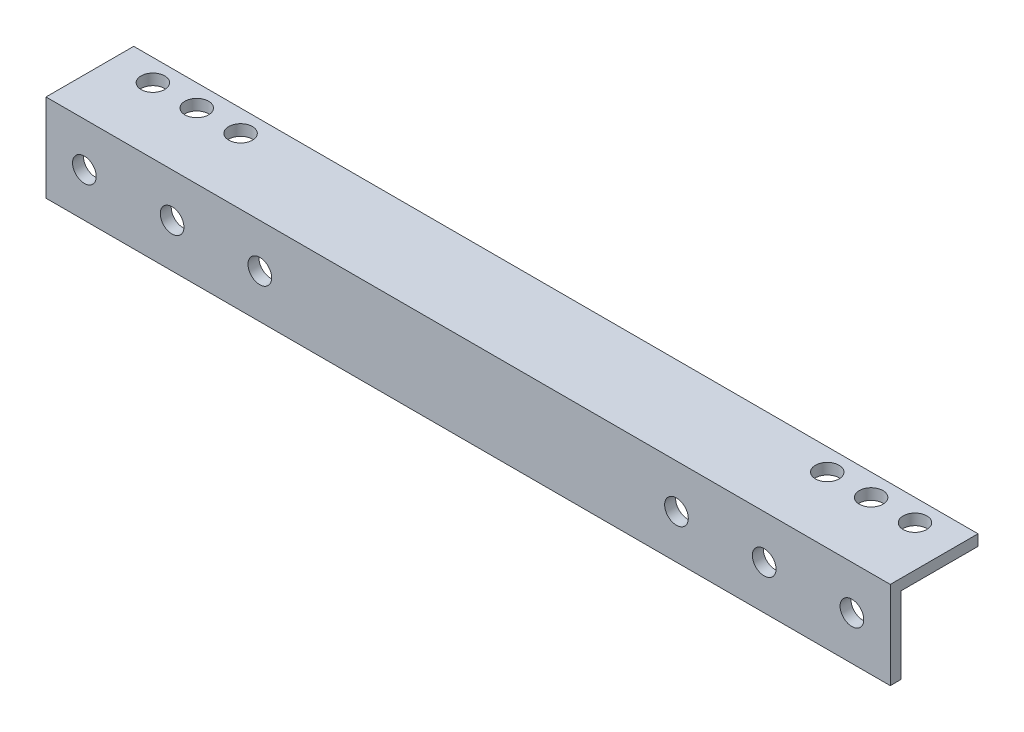
ISO-10303-21;
HEADER;
FILE_DESCRIPTION(('STEP AP214'),'2;1');
FILE_NAME('part.step','',(''),(''),'','','');
FILE_SCHEMA(('AUTOMOTIVE_DESIGN { 1 0 10303 214 1 1 1 1 }'));
ENDSEC;
DATA;
#1=APPLICATION_CONTEXT('core data for automotive mechanical design processes');
#2=APPLICATION_PROTOCOL_DEFINITION('international standard','automotive_design',2000,#1);
#3=PRODUCT_CONTEXT('',#1,'mechanical');
#4=PRODUCT('Part','Part','',(#3));
#5=PRODUCT_RELATED_PRODUCT_CATEGORY('part','',(#4));
#6=PRODUCT_DEFINITION_FORMATION('','',#4);
#7=PRODUCT_DEFINITION_CONTEXT('part definition',#1,'design');
#8=PRODUCT_DEFINITION('design','',#6,#7);
#9=PRODUCT_DEFINITION_SHAPE('','',#8);
#10=(LENGTH_UNIT() NAMED_UNIT(*) SI_UNIT(.MILLI.,.METRE.));
#11=(NAMED_UNIT(*) PLANE_ANGLE_UNIT() SI_UNIT($,.RADIAN.));
#12=(NAMED_UNIT(*) SI_UNIT($,.STERADIAN.) SOLID_ANGLE_UNIT());
#13=UNCERTAINTY_MEASURE_WITH_UNIT(LENGTH_MEASURE(1.E-05),#10,'distance_accuracy_value','');
#14=(GEOMETRIC_REPRESENTATION_CONTEXT(3) GLOBAL_UNCERTAINTY_ASSIGNED_CONTEXT((#13)) GLOBAL_UNIT_ASSIGNED_CONTEXT((#10,
#11,#12)) REPRESENTATION_CONTEXT('',''));
#15=CARTESIAN_POINT('',(0.,0.,0.));
#16=DIRECTION('',(0.,0.,1.));
#17=DIRECTION('',(1.,0.,0.));
#18=AXIS2_PLACEMENT_3D('',#15,#16,#17);
#19=CARTESIAN_POINT('',(244.475,0.,0.));
#20=DIRECTION('',(0.,0.,-1.));
#21=DIRECTION('',(0.,1.,0.));
#22=AXIS2_PLACEMENT_3D('',#19,#20,#21);
#23=PLANE('',#22);
#24=CARTESIAN_POINT('',(11.1125,-12.7,0.));
#25=DIRECTION('',(0.,0.,1.));
#26=DIRECTION('',(1.,0.,0.));
#27=AXIS2_PLACEMENT_3D('',#24,#25,#26);
#28=CIRCLE('',#27,3.429);
#29=CARTESIAN_POINT('',(14.5415,-12.7,0.));
#30=VERTEX_POINT('',#29);
#31=EDGE_CURVE('E172',#30,#30,#28,.T.);
#32=ORIENTED_EDGE('',*,*,#31,.F.);
#33=EDGE_LOOP('',(#32));
#34=FACE_BOUND('',#33,.T.);
#35=CARTESIAN_POINT('',(36.5125,-12.7,0.));
#36=DIRECTION('',(0.,0.,1.));
#37=DIRECTION('',(1.,0.,0.));
#38=AXIS2_PLACEMENT_3D('',#35,#36,#37);
#39=CIRCLE('',#38,3.429);
#40=CARTESIAN_POINT('',(39.9415,-12.7,0.));
#41=VERTEX_POINT('',#40);
#42=EDGE_CURVE('E176',#41,#41,#39,.T.);
#43=ORIENTED_EDGE('',*,*,#42,.F.);
#44=EDGE_LOOP('',(#43));
#45=FACE_BOUND('',#44,.T.);
#46=CARTESIAN_POINT('',(61.9125,-12.7,0.));
#47=DIRECTION('',(0.,0.,1.));
#48=DIRECTION('',(1.,0.,0.));
#49=AXIS2_PLACEMENT_3D('',#46,#47,#48);
#50=CIRCLE('',#49,3.429);
#51=CARTESIAN_POINT('',(65.3415,-12.7,0.));
#52=VERTEX_POINT('',#51);
#53=EDGE_CURVE('E180',#52,#52,#50,.T.);
#54=ORIENTED_EDGE('',*,*,#53,.F.);
#55=EDGE_LOOP('',(#54));
#56=FACE_BOUND('',#55,.T.);
#57=CARTESIAN_POINT('',(182.5625,-12.7,0.));
#58=DIRECTION('',(0.,0.,1.));
#59=DIRECTION('',(-1.,0.,0.));
#60=AXIS2_PLACEMENT_3D('',#57,#58,#59);
#61=CIRCLE('',#60,3.429);
#62=CARTESIAN_POINT('',(179.1335,-12.7,0.));
#63=VERTEX_POINT('',#62);
#64=EDGE_CURVE('E184',#63,#63,#61,.T.);
#65=ORIENTED_EDGE('',*,*,#64,.F.);
#66=EDGE_LOOP('',(#65));
#67=FACE_BOUND('',#66,.T.);
#68=CARTESIAN_POINT('',(207.9625,-12.7,0.));
#69=DIRECTION('',(0.,0.,1.));
#70=DIRECTION('',(-1.,0.,0.));
#71=AXIS2_PLACEMENT_3D('',#68,#69,#70);
#72=CIRCLE('',#71,3.429);
#73=CARTESIAN_POINT('',(204.5335,-12.7,0.));
#74=VERTEX_POINT('',#73);
#75=EDGE_CURVE('E188',#74,#74,#72,.T.);
#76=ORIENTED_EDGE('',*,*,#75,.F.);
#77=EDGE_LOOP('',(#76));
#78=FACE_BOUND('',#77,.T.);
#79=CARTESIAN_POINT('',(233.3625,-12.7,0.));
#80=DIRECTION('',(0.,0.,1.));
#81=DIRECTION('',(-1.,0.,0.));
#82=AXIS2_PLACEMENT_3D('',#79,#80,#81);
#83=CIRCLE('',#82,3.429);
#84=CARTESIAN_POINT('',(229.9335,-12.7,0.));
#85=VERTEX_POINT('',#84);
#86=EDGE_CURVE('E191',#85,#85,#83,.T.);
#87=ORIENTED_EDGE('',*,*,#86,.F.);
#88=EDGE_LOOP('',(#87));
#89=FACE_BOUND('',#88,.T.);
#90=DIRECTION('',(0.,-1.,0.));
#91=VECTOR('',#90,1.);
#92=CARTESIAN_POINT('',(0.,0.,0.));
#93=LINE('',#92,#91);
#94=CARTESIAN_POINT('',(0.,0.,0.));
#95=VERTEX_POINT('',#94);
#96=CARTESIAN_POINT('',(0.,-25.4,0.));
#97=VERTEX_POINT('',#96);
#98=EDGE_CURVE('E126',#95,#97,#93,.T.);
#99=ORIENTED_EDGE('',*,*,#98,.T.);
#100=DIRECTION('',(-1.,0.,0.));
#101=VECTOR('',#100,1.);
#102=CARTESIAN_POINT('',(244.475,-25.4,0.));
#103=LINE('',#102,#101);
#104=CARTESIAN_POINT('',(244.475,-25.4,0.));
#105=VERTEX_POINT('',#104);
#106=EDGE_CURVE('E11',#105,#97,#103,.T.);
#107=ORIENTED_EDGE('',*,*,#106,.F.);
#108=DIRECTION('',(0.,-1.,0.));
#109=VECTOR('',#108,1.);
#110=CARTESIAN_POINT('',(244.475,0.,0.));
#111=LINE('',#110,#109);
#112=CARTESIAN_POINT('',(244.475,0.,0.));
#113=VERTEX_POINT('',#112);
#114=EDGE_CURVE('E137',#113,#105,#111,.T.);
#115=ORIENTED_EDGE('',*,*,#114,.F.);
#116=DIRECTION('',(-1.,0.,0.));
#117=VECTOR('',#116,1.);
#118=CARTESIAN_POINT('',(244.475,0.,0.));
#119=LINE('',#118,#117);
#120=EDGE_CURVE('E122',#113,#95,#119,.T.);
#121=ORIENTED_EDGE('',*,*,#120,.T.);
#122=EDGE_LOOP('',(#99,#107,#115,#121));
#123=FACE_BOUND('',#122,.T.);
#124=ADVANCED_FACE('F42',(#34,#45,#56,#67,#78,#89,#123),#23,.F.);
#125=CARTESIAN_POINT('',(244.475,-25.4,-3.17499999999991));
#126=DIRECTION('',(0.,1.,0.));
#127=DIRECTION('',(0.,0.,1.));
#128=AXIS2_PLACEMENT_3D('',#125,#126,#127);
#129=PLANE('',#128);
#130=DIRECTION('',(0.,0.,-1.));
#131=VECTOR('',#130,1.);
#132=CARTESIAN_POINT('',(0.,-25.4,-3.17499999999991));
#133=LINE('',#132,#131);
#134=CARTESIAN_POINT('',(0.,-25.4,-3.17499999999991));
#135=VERTEX_POINT('',#134);
#136=EDGE_CURVE('E129',#97,#135,#133,.T.);
#137=ORIENTED_EDGE('',*,*,#136,.T.);
#138=DIRECTION('',(-1.,0.,0.));
#139=VECTOR('',#138,1.);
#140=CARTESIAN_POINT('',(244.475,-25.4,-3.17499999999991));
#141=LINE('',#140,#139);
#142=CARTESIAN_POINT('',(244.475,-25.4,-3.17499999999991));
#143=VERTEX_POINT('',#142);
#144=EDGE_CURVE('E50',#143,#135,#141,.T.);
#145=ORIENTED_EDGE('',*,*,#144,.F.);
#146=DIRECTION('',(0.,0.,-1.));
#147=VECTOR('',#146,1.);
#148=CARTESIAN_POINT('',(244.475,-25.4,-3.17499999999991));
#149=LINE('',#148,#147);
#150=EDGE_CURVE('E95',#105,#143,#149,.T.);
#151=ORIENTED_EDGE('',*,*,#150,.F.);
#152=ORIENTED_EDGE('',*,*,#106,.T.);
#153=EDGE_LOOP('',(#137,#145,#151,#152));
#154=FACE_BOUND('',#153,.T.);
#155=ADVANCED_FACE('F164',(#154),#129,.F.);
#156=CARTESIAN_POINT('',(244.475,-3.17500000000001,-3.17499999999999));
#157=DIRECTION('',(0.,0.,1.));
#158=DIRECTION('',(0.,-1.,0.));
#159=AXIS2_PLACEMENT_3D('',#156,#157,#158);
#160=PLANE('',#159);
#161=CARTESIAN_POINT('',(11.1125,-12.7,-3.17499999999996));
#162=DIRECTION('',(0.,0.,1.));
#163=DIRECTION('',(0.,-1.,0.));
#164=AXIS2_PLACEMENT_3D('',#161,#162,#163);
#165=CIRCLE('',#164,3.429);
#166=CARTESIAN_POINT('',(11.1125,-16.129,-3.17499999999994));
#167=VERTEX_POINT('',#166);
#168=EDGE_CURVE('E130',#167,#167,#165,.F.);
#169=ORIENTED_EDGE('',*,*,#168,.F.);
#170=EDGE_LOOP('',(#169));
#171=FACE_BOUND('',#170,.T.);
#172=CARTESIAN_POINT('',(36.5125,-12.7,-3.17499999999996));
#173=DIRECTION('',(0.,0.,1.));
#174=DIRECTION('',(0.,-1.,0.));
#175=AXIS2_PLACEMENT_3D('',#172,#173,#174);
#176=CIRCLE('',#175,3.429);
#177=CARTESIAN_POINT('',(36.5125,-16.129,-3.17499999999994));
#178=VERTEX_POINT('',#177);
#179=EDGE_CURVE('E211',#178,#178,#176,.F.);
#180=ORIENTED_EDGE('',*,*,#179,.F.);
#181=EDGE_LOOP('',(#180));
#182=FACE_BOUND('',#181,.T.);
#183=CARTESIAN_POINT('',(61.9125,-12.7,-3.17499999999996));
#184=DIRECTION('',(0.,0.,1.));
#185=DIRECTION('',(0.,-1.,0.));
#186=AXIS2_PLACEMENT_3D('',#183,#184,#185);
#187=CIRCLE('',#186,3.429);
#188=CARTESIAN_POINT('',(61.9125,-16.129,-3.17499999999994));
#189=VERTEX_POINT('',#188);
#190=EDGE_CURVE('E207',#189,#189,#187,.F.);
#191=ORIENTED_EDGE('',*,*,#190,.F.);
#192=EDGE_LOOP('',(#191));
#193=FACE_BOUND('',#192,.T.);
#194=CARTESIAN_POINT('',(182.5625,-12.7,-3.17499999999996));
#195=DIRECTION('',(0.,0.,1.));
#196=DIRECTION('',(0.,-1.,0.));
#197=AXIS2_PLACEMENT_3D('',#194,#195,#196);
#198=CIRCLE('',#197,3.429);
#199=CARTESIAN_POINT('',(182.5625,-16.129,-3.17499999999994));
#200=VERTEX_POINT('',#199);
#201=EDGE_CURVE('E204',#200,#200,#198,.F.);
#202=ORIENTED_EDGE('',*,*,#201,.F.);
#203=EDGE_LOOP('',(#202));
#204=FACE_BOUND('',#203,.T.);
#205=CARTESIAN_POINT('',(207.9625,-12.7,-3.17499999999996));
#206=DIRECTION('',(0.,0.,1.));
#207=DIRECTION('',(0.,-1.,0.));
#208=AXIS2_PLACEMENT_3D('',#205,#206,#207);
#209=CIRCLE('',#208,3.429);
#210=CARTESIAN_POINT('',(207.9625,-16.129,-3.17499999999994));
#211=VERTEX_POINT('',#210);
#212=EDGE_CURVE('E193',#211,#211,#209,.F.);
#213=ORIENTED_EDGE('',*,*,#212,.F.);
#214=EDGE_LOOP('',(#213));
#215=FACE_BOUND('',#214,.T.);
#216=CARTESIAN_POINT('',(233.3625,-12.7,-3.17499999999996));
#217=DIRECTION('',(0.,0.,1.));
#218=DIRECTION('',(0.,-1.,0.));
#219=AXIS2_PLACEMENT_3D('',#216,#217,#218);
#220=CIRCLE('',#219,3.429);
#221=CARTESIAN_POINT('',(233.3625,-16.129,-3.17499999999994));
#222=VERTEX_POINT('',#221);
#223=EDGE_CURVE('E194',#222,#222,#220,.F.);
#224=ORIENTED_EDGE('',*,*,#223,.F.);
#225=EDGE_LOOP('',(#224));
#226=FACE_BOUND('',#225,.T.);
#227=DIRECTION('',(0.,1.,0.));
#228=VECTOR('',#227,1.);
#229=CARTESIAN_POINT('',(0.,-3.17500000000001,-3.17499999999999));
#230=LINE('',#229,#228);
#231=CARTESIAN_POINT('',(0.,-3.17500000000001,-3.17499999999999));
#232=VERTEX_POINT('',#231);
#233=EDGE_CURVE('E132',#135,#232,#230,.T.);
#234=ORIENTED_EDGE('',*,*,#233,.T.);
#235=DIRECTION('',(-1.,0.,0.));
#236=VECTOR('',#235,1.);
#237=CARTESIAN_POINT('',(244.475,-3.17500000000001,-3.17499999999999));
#238=LINE('',#237,#236);
#239=CARTESIAN_POINT('',(244.475,-3.17500000000001,-3.17499999999999));
#240=VERTEX_POINT('',#239);
#241=EDGE_CURVE('E117',#240,#232,#238,.T.);
#242=ORIENTED_EDGE('',*,*,#241,.F.);
#243=DIRECTION('',(0.,1.,0.));
#244=VECTOR('',#243,1.);
#245=CARTESIAN_POINT('',(244.475,-3.17500000000001,-3.17499999999999));
#246=LINE('',#245,#244);
#247=EDGE_CURVE('E108',#143,#240,#246,.T.);
#248=ORIENTED_EDGE('',*,*,#247,.F.);
#249=ORIENTED_EDGE('',*,*,#144,.T.);
#250=EDGE_LOOP('',(#234,#242,#248,#249));
#251=FACE_BOUND('',#250,.T.);
#252=ADVANCED_FACE('F143',(#171,#182,#193,#204,#215,#226,#251),#160,.F.);
#253=CARTESIAN_POINT('',(244.475,-3.17500000000001,-3.17499999999999));
#254=DIRECTION('',(0.,1.,0.));
#255=DIRECTION('',(0.,0.,1.));
#256=AXIS2_PLACEMENT_3D('',#253,#254,#255);
#257=PLANE('',#256);
#258=CARTESIAN_POINT('',(219.8751,-3.17500000000007,-19.05));
#259=DIRECTION('',(0.,1.,0.));
#260=DIRECTION('',(0.,0.,1.));
#261=AXIS2_PLACEMENT_3D('',#258,#259,#260);
#262=CIRCLE('',#261,3.42900000000006);
#263=CARTESIAN_POINT('',(219.8751,-3.17500000000005,-15.6209999999999));
#264=VERTEX_POINT('',#263);
#265=EDGE_CURVE('E243',#264,#264,#262,.F.);
#266=ORIENTED_EDGE('',*,*,#265,.F.);
#267=EDGE_LOOP('',(#266));
#268=FACE_BOUND('',#267,.T.);
#269=CARTESIAN_POINT('',(232.5751,-3.17500000000007,-19.05));
#270=DIRECTION('',(0.,1.,0.));
#271=DIRECTION('',(0.,0.,1.));
#272=AXIS2_PLACEMENT_3D('',#269,#270,#271);
#273=CIRCLE('',#272,3.429);
#274=CARTESIAN_POINT('',(232.5751,-3.17500000000005,-15.621));
#275=VERTEX_POINT('',#274);
#276=EDGE_CURVE('E237',#275,#275,#273,.F.);
#277=ORIENTED_EDGE('',*,*,#276,.F.);
#278=EDGE_LOOP('',(#277));
#279=FACE_BOUND('',#278,.T.);
#280=CARTESIAN_POINT('',(11.8999,-3.17500000000007,-19.0499999999999));
#281=DIRECTION('',(0.,1.,0.));
#282=DIRECTION('',(0.,0.,1.));
#283=AXIS2_PLACEMENT_3D('',#280,#281,#282);
#284=CIRCLE('',#283,3.42900000000001);
#285=CARTESIAN_POINT('',(11.8999,-3.17500000000005,-15.6209999999999));
#286=VERTEX_POINT('',#285);
#287=EDGE_CURVE('E229',#286,#286,#284,.F.);
#288=ORIENTED_EDGE('',*,*,#287,.F.);
#289=EDGE_LOOP('',(#288));
#290=FACE_BOUND('',#289,.T.);
#291=CARTESIAN_POINT('',(24.5999,-3.17500000000007,-19.0499999999999));
#292=DIRECTION('',(0.,1.,0.));
#293=DIRECTION('',(0.,0.,1.));
#294=AXIS2_PLACEMENT_3D('',#291,#292,#293);
#295=CIRCLE('',#294,3.42900000000001);
#296=CARTESIAN_POINT('',(24.5999,-3.17500000000005,-15.6209999999999));
#297=VERTEX_POINT('',#296);
#298=EDGE_CURVE('E230',#297,#297,#295,.F.);
#299=ORIENTED_EDGE('',*,*,#298,.F.);
#300=EDGE_LOOP('',(#299));
#301=FACE_BOUND('',#300,.T.);
#302=CARTESIAN_POINT('',(37.2999,-3.17500000000007,-19.0499999999999));
#303=DIRECTION('',(0.,1.,0.));
#304=DIRECTION('',(0.,0.,1.));
#305=AXIS2_PLACEMENT_3D('',#302,#303,#304);
#306=CIRCLE('',#305,3.429);
#307=CARTESIAN_POINT('',(37.2999,-3.17500000000005,-15.621));
#308=VERTEX_POINT('',#307);
#309=EDGE_CURVE('E252',#308,#308,#306,.F.);
#310=ORIENTED_EDGE('',*,*,#309,.F.);
#311=EDGE_LOOP('',(#310));
#312=FACE_BOUND('',#311,.T.);
#313=CARTESIAN_POINT('',(207.1751,-3.17500000000007,-19.05));
#314=DIRECTION('',(0.,1.,0.));
#315=DIRECTION('',(0.,0.,1.));
#316=AXIS2_PLACEMENT_3D('',#313,#314,#315);
#317=CIRCLE('',#316,3.429);
#318=CARTESIAN_POINT('',(207.1751,-3.17500000000005,-15.621));
#319=VERTEX_POINT('',#318);
#320=EDGE_CURVE('E199',#319,#319,#317,.F.);
#321=ORIENTED_EDGE('',*,*,#320,.F.);
#322=EDGE_LOOP('',(#321));
#323=FACE_BOUND('',#322,.T.);
#324=DIRECTION('',(0.,0.,-1.));
#325=VECTOR('',#324,1.);
#326=CARTESIAN_POINT('',(0.,-3.17500000000001,-3.17499999999999));
#327=LINE('',#326,#325);
#328=CARTESIAN_POINT('',(0.,-3.17500000000009,-25.4));
#329=VERTEX_POINT('',#328);
#330=EDGE_CURVE('E116',#232,#329,#327,.T.);
#331=ORIENTED_EDGE('',*,*,#330,.T.);
#332=DIRECTION('',(-1.,0.,0.));
#333=VECTOR('',#332,1.);
#334=CARTESIAN_POINT('',(244.475,-3.17500000000009,-25.4));
#335=LINE('',#334,#333);
#336=CARTESIAN_POINT('',(244.475,-3.17500000000009,-25.4));
#337=VERTEX_POINT('',#336);
#338=EDGE_CURVE('E113',#337,#329,#335,.T.);
#339=ORIENTED_EDGE('',*,*,#338,.F.);
#340=DIRECTION('',(0.,0.,-1.));
#341=VECTOR('',#340,1.);
#342=CARTESIAN_POINT('',(244.475,-3.17500000000001,-3.17499999999999));
#343=LINE('',#342,#341);
#344=EDGE_CURVE('E102',#240,#337,#343,.T.);
#345=ORIENTED_EDGE('',*,*,#344,.F.);
#346=ORIENTED_EDGE('',*,*,#241,.T.);
#347=EDGE_LOOP('',(#331,#339,#345,#346));
#348=FACE_BOUND('',#347,.T.);
#349=ADVANCED_FACE('F114',(#268,#279,#290,#301,#312,#323,#348),#257,.F.);
#350=CARTESIAN_POINT('',(244.475,-3.17500000000009,-25.4));
#351=DIRECTION('',(0.,0.,1.));
#352=DIRECTION('',(0.,-1.,0.));
#353=AXIS2_PLACEMENT_3D('',#350,#351,#352);
#354=PLANE('',#353);
#355=DIRECTION('',(0.,1.,0.));
#356=VECTOR('',#355,1.);
#357=CARTESIAN_POINT('',(0.,-3.17500000000009,-25.4));
#358=LINE('',#357,#356);
#359=CARTESIAN_POINT('',(0.,0.,-25.4));
#360=VERTEX_POINT('',#359);
#361=EDGE_CURVE('E81',#329,#360,#358,.T.);
#362=ORIENTED_EDGE('',*,*,#361,.T.);
#363=DIRECTION('',(-1.,0.,0.));
#364=VECTOR('',#363,1.);
#365=CARTESIAN_POINT('',(244.475,0.,-25.4));
#366=LINE('',#365,#364);
#367=CARTESIAN_POINT('',(244.475,0.,-25.4));
#368=VERTEX_POINT('',#367);
#369=EDGE_CURVE('E118',#368,#360,#366,.T.);
#370=ORIENTED_EDGE('',*,*,#369,.F.);
#371=DIRECTION('',(0.,1.,0.));
#372=VECTOR('',#371,1.);
#373=CARTESIAN_POINT('',(244.475,-3.17500000000009,-25.4));
#374=LINE('',#373,#372);
#375=EDGE_CURVE('E106',#337,#368,#374,.T.);
#376=ORIENTED_EDGE('',*,*,#375,.F.);
#377=ORIENTED_EDGE('',*,*,#338,.T.);
#378=EDGE_LOOP('',(#362,#370,#376,#377));
#379=FACE_BOUND('',#378,.T.);
#380=ADVANCED_FACE('F120',(#379),#354,.F.);
#381=CARTESIAN_POINT('',(244.475,0.,0.));
#382=DIRECTION('',(0.,-1.,0.));
#383=DIRECTION('',(0.,0.,-1.));
#384=AXIS2_PLACEMENT_3D('',#381,#382,#383);
#385=PLANE('',#384);
#386=CARTESIAN_POINT('',(219.8751,0.,-19.05));
#387=DIRECTION('',(0.,1.,0.));
#388=DIRECTION('',(0.,0.,-1.));
#389=AXIS2_PLACEMENT_3D('',#386,#387,#388);
#390=CIRCLE('',#389,3.42900000000006);
#391=CARTESIAN_POINT('',(219.8751,0.,-22.479));
#392=VERTEX_POINT('',#391);
#393=EDGE_CURVE('E225',#392,#392,#390,.T.);
#394=ORIENTED_EDGE('',*,*,#393,.F.);
#395=EDGE_LOOP('',(#394));
#396=FACE_BOUND('',#395,.T.);
#397=CARTESIAN_POINT('',(232.5751,0.,-19.05));
#398=DIRECTION('',(0.,1.,0.));
#399=DIRECTION('',(0.,0.,-1.));
#400=AXIS2_PLACEMENT_3D('',#397,#398,#399);
#401=CIRCLE('',#400,3.429);
#402=CARTESIAN_POINT('',(232.5751,0.,-22.479));
#403=VERTEX_POINT('',#402);
#404=EDGE_CURVE('E240',#403,#403,#401,.T.);
#405=ORIENTED_EDGE('',*,*,#404,.F.);
#406=EDGE_LOOP('',(#405));
#407=FACE_BOUND('',#406,.T.);
#408=CARTESIAN_POINT('',(11.8999,0.,-19.05));
#409=DIRECTION('',(0.,1.,0.));
#410=DIRECTION('',(0.,0.,1.));
#411=AXIS2_PLACEMENT_3D('',#408,#409,#410);
#412=CIRCLE('',#411,3.42900000000001);
#413=CARTESIAN_POINT('',(11.8999,0.,-15.621));
#414=VERTEX_POINT('',#413);
#415=EDGE_CURVE('E234',#414,#414,#412,.T.);
#416=ORIENTED_EDGE('',*,*,#415,.F.);
#417=EDGE_LOOP('',(#416));
#418=FACE_BOUND('',#417,.T.);
#419=CARTESIAN_POINT('',(24.5999,0.,-19.05));
#420=DIRECTION('',(0.,1.,0.));
#421=DIRECTION('',(0.,0.,1.));
#422=AXIS2_PLACEMENT_3D('',#419,#420,#421);
#423=CIRCLE('',#422,3.42900000000001);
#424=CARTESIAN_POINT('',(24.5999,0.,-15.621));
#425=VERTEX_POINT('',#424);
#426=EDGE_CURVE('E226',#425,#425,#423,.T.);
#427=ORIENTED_EDGE('',*,*,#426,.F.);
#428=EDGE_LOOP('',(#427));
#429=FACE_BOUND('',#428,.T.);
#430=CARTESIAN_POINT('',(37.2999,0.,-19.05));
#431=DIRECTION('',(0.,1.,0.));
#432=DIRECTION('',(0.,0.,1.));
#433=AXIS2_PLACEMENT_3D('',#430,#431,#432);
#434=CIRCLE('',#433,3.429);
#435=CARTESIAN_POINT('',(37.2999,0.,-15.621));
#436=VERTEX_POINT('',#435);
#437=EDGE_CURVE('E233',#436,#436,#434,.T.);
#438=ORIENTED_EDGE('',*,*,#437,.F.);
#439=EDGE_LOOP('',(#438));
#440=FACE_BOUND('',#439,.T.);
#441=CARTESIAN_POINT('',(207.1751,0.,-19.05));
#442=DIRECTION('',(0.,1.,0.));
#443=DIRECTION('',(0.,0.,-1.));
#444=AXIS2_PLACEMENT_3D('',#441,#442,#443);
#445=CIRCLE('',#444,3.429);
#446=CARTESIAN_POINT('',(207.1751,0.,-22.479));
#447=VERTEX_POINT('',#446);
#448=EDGE_CURVE('E222',#447,#447,#445,.T.);
#449=ORIENTED_EDGE('',*,*,#448,.F.);
#450=EDGE_LOOP('',(#449));
#451=FACE_BOUND('',#450,.T.);
#452=DIRECTION('',(0.,0.,1.));
#453=VECTOR('',#452,1.);
#454=CARTESIAN_POINT('',(0.,0.,0.));
#455=LINE('',#454,#453);
#456=EDGE_CURVE('E87',#360,#95,#455,.T.);
#457=ORIENTED_EDGE('',*,*,#456,.T.);
#458=ORIENTED_EDGE('',*,*,#120,.F.);
#459=DIRECTION('',(0.,0.,1.));
#460=VECTOR('',#459,1.);
#461=CARTESIAN_POINT('',(244.475,0.,0.));
#462=LINE('',#461,#460);
#463=EDGE_CURVE('E58',#368,#113,#462,.T.);
#464=ORIENTED_EDGE('',*,*,#463,.F.);
#465=ORIENTED_EDGE('',*,*,#369,.T.);
#466=EDGE_LOOP('',(#457,#458,#464,#465));
#467=FACE_BOUND('',#466,.T.);
#468=ADVANCED_FACE('F150',(#396,#407,#418,#429,#440,#451,#467),#385,.F.);
#469=CARTESIAN_POINT('',(244.475,0.,0.));
#470=DIRECTION('',(-1.,0.,0.));
#471=DIRECTION('',(0.,0.,1.));
#472=AXIS2_PLACEMENT_3D('',#469,#470,#471);
#473=PLANE('',#472);
#474=ORIENTED_EDGE('',*,*,#114,.T.);
#475=ORIENTED_EDGE('',*,*,#150,.T.);
#476=ORIENTED_EDGE('',*,*,#247,.T.);
#477=ORIENTED_EDGE('',*,*,#344,.T.);
#478=ORIENTED_EDGE('',*,*,#375,.T.);
#479=ORIENTED_EDGE('',*,*,#463,.T.);
#480=EDGE_LOOP('',(#474,#475,#476,#477,#478,#479));
#481=FACE_BOUND('',#480,.T.);
#482=ADVANCED_FACE('F104',(#481),#473,.F.);
#483=CARTESIAN_POINT('',(0.,0.,0.));
#484=DIRECTION('',(-1.,0.,0.));
#485=DIRECTION('',(0.,0.,1.));
#486=AXIS2_PLACEMENT_3D('',#483,#484,#485);
#487=PLANE('',#486);
#488=ORIENTED_EDGE('',*,*,#98,.F.);
#489=ORIENTED_EDGE('',*,*,#456,.F.);
#490=ORIENTED_EDGE('',*,*,#361,.F.);
#491=ORIENTED_EDGE('',*,*,#330,.F.);
#492=ORIENTED_EDGE('',*,*,#233,.F.);
#493=ORIENTED_EDGE('',*,*,#136,.F.);
#494=EDGE_LOOP('',(#488,#489,#490,#491,#492,#493));
#495=FACE_BOUND('',#494,.T.);
#496=ADVANCED_FACE('F146',(#495),#487,.T.);
#497=CARTESIAN_POINT('',(233.3625,-12.7,-12.8736766107546));
#498=DIRECTION('',(0.,0.,1.));
#499=DIRECTION('',(1.,0.,0.));
#500=AXIS2_PLACEMENT_3D('',#497,#498,#499);
#501=CYLINDRICAL_SURFACE('',#500,3.429);
#502=ORIENTED_EDGE('',*,*,#223,.T.);
#503=EDGE_LOOP('',(#502));
#504=FACE_BOUND('',#503,.T.);
#505=ORIENTED_EDGE('',*,*,#86,.T.);
#506=EDGE_LOOP('',(#505));
#507=FACE_BOUND('',#506,.T.);
#508=ADVANCED_FACE('F298',(#504,#507),#501,.F.);
#509=CARTESIAN_POINT('',(207.9625,-12.7,-12.8736766107546));
#510=DIRECTION('',(0.,0.,1.));
#511=DIRECTION('',(1.,0.,0.));
#512=AXIS2_PLACEMENT_3D('',#509,#510,#511);
#513=CYLINDRICAL_SURFACE('',#512,3.429);
#514=ORIENTED_EDGE('',*,*,#212,.T.);
#515=EDGE_LOOP('',(#514));
#516=FACE_BOUND('',#515,.T.);
#517=ORIENTED_EDGE('',*,*,#75,.T.);
#518=EDGE_LOOP('',(#517));
#519=FACE_BOUND('',#518,.T.);
#520=ADVANCED_FACE('F294',(#516,#519),#513,.F.);
#521=CARTESIAN_POINT('',(182.5625,-12.7,-12.8736766107546));
#522=DIRECTION('',(0.,0.,1.));
#523=DIRECTION('',(1.,0.,0.));
#524=AXIS2_PLACEMENT_3D('',#521,#522,#523);
#525=CYLINDRICAL_SURFACE('',#524,3.429);
#526=ORIENTED_EDGE('',*,*,#201,.T.);
#527=EDGE_LOOP('',(#526));
#528=FACE_BOUND('',#527,.T.);
#529=ORIENTED_EDGE('',*,*,#64,.T.);
#530=EDGE_LOOP('',(#529));
#531=FACE_BOUND('',#530,.T.);
#532=ADVANCED_FACE('F290',(#528,#531),#525,.F.);
#533=CARTESIAN_POINT('',(61.9125,-12.7,-12.8736766107546));
#534=DIRECTION('',(0.,0.,1.));
#535=DIRECTION('',(1.,0.,0.));
#536=AXIS2_PLACEMENT_3D('',#533,#534,#535);
#537=CYLINDRICAL_SURFACE('',#536,3.429);
#538=ORIENTED_EDGE('',*,*,#190,.T.);
#539=EDGE_LOOP('',(#538));
#540=FACE_BOUND('',#539,.T.);
#541=ORIENTED_EDGE('',*,*,#53,.T.);
#542=EDGE_LOOP('',(#541));
#543=FACE_BOUND('',#542,.T.);
#544=ADVANCED_FACE('F286',(#540,#543),#537,.F.);
#545=CARTESIAN_POINT('',(36.5125,-12.7,-12.8736766107546));
#546=DIRECTION('',(0.,0.,1.));
#547=DIRECTION('',(1.,0.,0.));
#548=AXIS2_PLACEMENT_3D('',#545,#546,#547);
#549=CYLINDRICAL_SURFACE('',#548,3.429);
#550=ORIENTED_EDGE('',*,*,#179,.T.);
#551=EDGE_LOOP('',(#550));
#552=FACE_BOUND('',#551,.T.);
#553=ORIENTED_EDGE('',*,*,#42,.T.);
#554=EDGE_LOOP('',(#553));
#555=FACE_BOUND('',#554,.T.);
#556=ADVANCED_FACE('F278',(#552,#555),#549,.F.);
#557=CARTESIAN_POINT('',(11.1125,-12.7,-12.8736766107546));
#558=DIRECTION('',(0.,0.,1.));
#559=DIRECTION('',(1.,0.,0.));
#560=AXIS2_PLACEMENT_3D('',#557,#558,#559);
#561=CYLINDRICAL_SURFACE('',#560,3.429);
#562=ORIENTED_EDGE('',*,*,#168,.T.);
#563=EDGE_LOOP('',(#562));
#564=FACE_BOUND('',#563,.T.);
#565=ORIENTED_EDGE('',*,*,#31,.T.);
#566=EDGE_LOOP('',(#565));
#567=FACE_BOUND('',#566,.T.);
#568=ADVANCED_FACE('F268',(#564,#567),#561,.F.);
#569=CARTESIAN_POINT('',(207.1751,-12.8736766107549,-19.0499999999999));
#570=DIRECTION('',(0.,1.,0.));
#571=DIRECTION('',(0.,0.,1.));
#572=AXIS2_PLACEMENT_3D('',#569,#570,#571);
#573=CYLINDRICAL_SURFACE('',#572,3.429);
#574=ORIENTED_EDGE('',*,*,#320,.T.);
#575=EDGE_LOOP('',(#574));
#576=FACE_BOUND('',#575,.T.);
#577=ORIENTED_EDGE('',*,*,#448,.T.);
#578=EDGE_LOOP('',(#577));
#579=FACE_BOUND('',#578,.T.);
#580=ADVANCED_FACE('F265',(#576,#579),#573,.F.);
#581=CARTESIAN_POINT('',(37.2999,-12.8736766107549,-19.0499999999999));
#582=DIRECTION('',(0.,1.,0.));
#583=DIRECTION('',(0.,0.,1.));
#584=AXIS2_PLACEMENT_3D('',#581,#582,#583);
#585=CYLINDRICAL_SURFACE('',#584,3.429);
#586=ORIENTED_EDGE('',*,*,#309,.T.);
#587=EDGE_LOOP('',(#586));
#588=FACE_BOUND('',#587,.T.);
#589=ORIENTED_EDGE('',*,*,#437,.T.);
#590=EDGE_LOOP('',(#589));
#591=FACE_BOUND('',#590,.T.);
#592=ADVANCED_FACE('F256',(#588,#591),#585,.F.);
#593=CARTESIAN_POINT('',(24.5999,-12.8736766107549,-19.0499999999999));
#594=DIRECTION('',(0.,1.,0.));
#595=DIRECTION('',(0.,0.,1.));
#596=AXIS2_PLACEMENT_3D('',#593,#594,#595);
#597=CYLINDRICAL_SURFACE('',#596,3.42900000000001);
#598=ORIENTED_EDGE('',*,*,#298,.T.);
#599=EDGE_LOOP('',(#598));
#600=FACE_BOUND('',#599,.T.);
#601=ORIENTED_EDGE('',*,*,#426,.T.);
#602=EDGE_LOOP('',(#601));
#603=FACE_BOUND('',#602,.T.);
#604=ADVANCED_FACE('F276',(#600,#603),#597,.F.);
#605=CARTESIAN_POINT('',(11.8999,-12.8736766107549,-19.0499999999999));
#606=DIRECTION('',(0.,1.,0.));
#607=DIRECTION('',(0.,0.,1.));
#608=AXIS2_PLACEMENT_3D('',#605,#606,#607);
#609=CYLINDRICAL_SURFACE('',#608,3.42900000000001);
#610=ORIENTED_EDGE('',*,*,#287,.T.);
#611=EDGE_LOOP('',(#610));
#612=FACE_BOUND('',#611,.T.);
#613=ORIENTED_EDGE('',*,*,#415,.T.);
#614=EDGE_LOOP('',(#613));
#615=FACE_BOUND('',#614,.T.);
#616=ADVANCED_FACE('F370',(#612,#615),#609,.F.);
#617=CARTESIAN_POINT('',(232.5751,-12.8736766107549,-19.0499999999999));
#618=DIRECTION('',(0.,1.,0.));
#619=DIRECTION('',(0.,0.,1.));
#620=AXIS2_PLACEMENT_3D('',#617,#618,#619);
#621=CYLINDRICAL_SURFACE('',#620,3.429);
#622=ORIENTED_EDGE('',*,*,#276,.T.);
#623=EDGE_LOOP('',(#622));
#624=FACE_BOUND('',#623,.T.);
#625=ORIENTED_EDGE('',*,*,#404,.T.);
#626=EDGE_LOOP('',(#625));
#627=FACE_BOUND('',#626,.T.);
#628=ADVANCED_FACE('F380',(#624,#627),#621,.F.);
#629=CARTESIAN_POINT('',(219.8751,-12.8736766107549,-19.0499999999999));
#630=DIRECTION('',(0.,1.,0.));
#631=DIRECTION('',(0.,0.,1.));
#632=AXIS2_PLACEMENT_3D('',#629,#630,#631);
#633=CYLINDRICAL_SURFACE('',#632,3.42900000000006);
#634=ORIENTED_EDGE('',*,*,#265,.T.);
#635=EDGE_LOOP('',(#634));
#636=FACE_BOUND('',#635,.T.);
#637=ORIENTED_EDGE('',*,*,#393,.T.);
#638=EDGE_LOOP('',(#637));
#639=FACE_BOUND('',#638,.T.);
#640=ADVANCED_FACE('F390',(#636,#639),#633,.F.);
#641=CLOSED_SHELL('',(#124,#155,#252,#349,#380,#468,#482,#496,#508,#520,#532,#544,#556,#568,
#580,#592,#604,#616,#628,#640));
#642=MANIFOLD_SOLID_BREP('B2',#641);
#643=ADVANCED_BREP_SHAPE_REPRESENTATION('',(#18,#642),#14);
#644=SHAPE_DEFINITION_REPRESENTATION(#9,#643);
ENDSEC;
END-ISO-10303-21;
